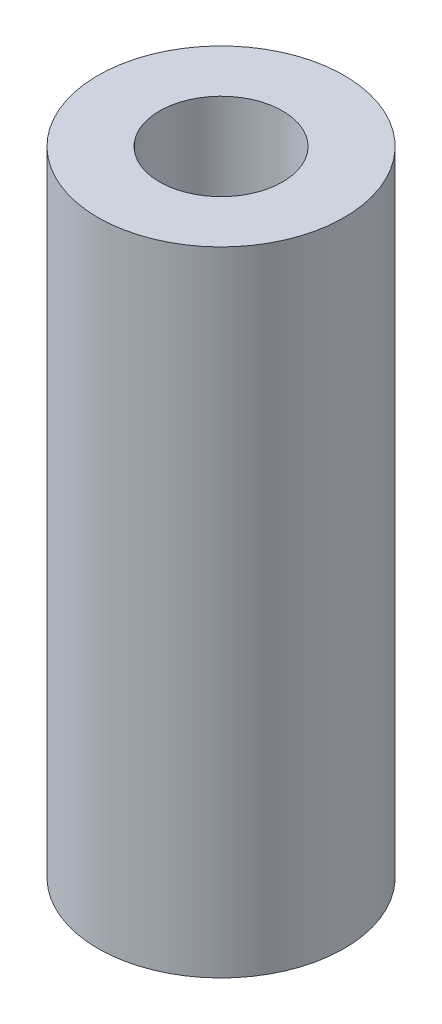
ISO-10303-21;
HEADER;
FILE_DESCRIPTION(('STEP AP214'),'2;1');
FILE_NAME('part.step','',(''),(''),'','','');
FILE_SCHEMA(('AUTOMOTIVE_DESIGN { 1 0 10303 214 1 1 1 1 }'));
ENDSEC;
DATA;
#1=APPLICATION_CONTEXT('core data for automotive mechanical design processes');
#2=APPLICATION_PROTOCOL_DEFINITION('international standard','automotive_design',2000,#1);
#3=PRODUCT_CONTEXT('',#1,'mechanical');
#4=PRODUCT('Part','Part','',(#3));
#5=PRODUCT_RELATED_PRODUCT_CATEGORY('part','',(#4));
#6=PRODUCT_DEFINITION_FORMATION('','',#4);
#7=PRODUCT_DEFINITION_CONTEXT('part definition',#1,'design');
#8=PRODUCT_DEFINITION('design','',#6,#7);
#9=PRODUCT_DEFINITION_SHAPE('','',#8);
#10=(LENGTH_UNIT() NAMED_UNIT(*) SI_UNIT(.MILLI.,.METRE.));
#11=(NAMED_UNIT(*) PLANE_ANGLE_UNIT() SI_UNIT($,.RADIAN.));
#12=(NAMED_UNIT(*) SI_UNIT($,.STERADIAN.) SOLID_ANGLE_UNIT());
#13=UNCERTAINTY_MEASURE_WITH_UNIT(LENGTH_MEASURE(1.E-05),#10,'distance_accuracy_value','');
#14=(GEOMETRIC_REPRESENTATION_CONTEXT(3) GLOBAL_UNCERTAINTY_ASSIGNED_CONTEXT((#13)) GLOBAL_UNIT_ASSIGNED_CONTEXT((#10,
#11,#12)) REPRESENTATION_CONTEXT('',''));
#15=CARTESIAN_POINT('',(0.,0.,0.));
#16=DIRECTION('',(0.,0.,1.));
#17=DIRECTION('',(1.,0.,0.));
#18=AXIS2_PLACEMENT_3D('',#15,#16,#17);
#19=CARTESIAN_POINT('',(0.,18.,0.));
#20=DIRECTION('',(0.,1.,0.));
#21=DIRECTION('',(0.,0.,1.));
#22=AXIS2_PLACEMENT_3D('',#19,#20,#21);
#23=PLANE('',#22);
#24=CARTESIAN_POINT('',(0.,18.,0.));
#25=DIRECTION('',(0.,1.,0.));
#26=DIRECTION('',(0.,0.,1.));
#27=AXIS2_PLACEMENT_3D('',#24,#25,#26);
#28=CIRCLE('',#27,3.5);
#29=CARTESIAN_POINT('',(0.,18.,3.5));
#30=VERTEX_POINT('',#29);
#31=EDGE_CURVE('E10',#30,#30,#28,.T.);
#32=ORIENTED_EDGE('',*,*,#31,.T.);
#33=EDGE_LOOP('',(#32));
#34=FACE_BOUND('',#33,.T.);
#35=CARTESIAN_POINT('',(0.,18.,0.));
#36=DIRECTION('',(0.,1.,0.));
#37=DIRECTION('',(0.,0.,1.));
#38=AXIS2_PLACEMENT_3D('',#35,#36,#37);
#39=CIRCLE('',#38,1.75);
#40=CARTESIAN_POINT('',(0.,18.,1.75));
#41=VERTEX_POINT('',#40);
#42=EDGE_CURVE('E42',#41,#41,#39,.T.);
#43=ORIENTED_EDGE('',*,*,#42,.F.);
#44=EDGE_LOOP('',(#43));
#45=FACE_BOUND('',#44,.T.);
#46=ADVANCED_FACE('F31',(#34,#45),#23,.T.);
#47=CARTESIAN_POINT('',(0.,0.,0.));
#48=DIRECTION('',(0.,1.,0.));
#49=DIRECTION('',(0.,0.,1.));
#50=AXIS2_PLACEMENT_3D('',#47,#48,#49);
#51=PLANE('',#50);
#52=CARTESIAN_POINT('',(0.,0.,0.));
#53=DIRECTION('',(0.,1.,0.));
#54=DIRECTION('',(0.,0.,1.));
#55=AXIS2_PLACEMENT_3D('',#52,#53,#54);
#56=CIRCLE('',#55,3.5);
#57=CARTESIAN_POINT('',(0.,0.,3.5));
#58=VERTEX_POINT('',#57);
#59=EDGE_CURVE('E35',#58,#58,#56,.T.);
#60=ORIENTED_EDGE('',*,*,#59,.F.);
#61=EDGE_LOOP('',(#60));
#62=FACE_BOUND('',#61,.T.);
#63=CARTESIAN_POINT('',(0.,0.,0.));
#64=DIRECTION('',(0.,1.,0.));
#65=DIRECTION('',(0.,0.,1.));
#66=AXIS2_PLACEMENT_3D('',#63,#64,#65);
#67=CIRCLE('',#66,1.75);
#68=CARTESIAN_POINT('',(0.,0.,1.75));
#69=VERTEX_POINT('',#68);
#70=EDGE_CURVE('E44',#69,#69,#67,.T.);
#71=ORIENTED_EDGE('',*,*,#70,.T.);
#72=EDGE_LOOP('',(#71));
#73=FACE_BOUND('',#72,.T.);
#74=ADVANCED_FACE('F54',(#62,#73),#51,.F.);
#75=CARTESIAN_POINT('',(0.,18.,0.));
#76=DIRECTION('',(0.,-1.,0.));
#77=DIRECTION('',(0.,0.,-1.));
#78=AXIS2_PLACEMENT_3D('',#75,#76,#77);
#79=CYLINDRICAL_SURFACE('',#78,3.5);
#80=ORIENTED_EDGE('',*,*,#31,.F.);
#81=EDGE_LOOP('',(#80));
#82=FACE_BOUND('',#81,.T.);
#83=ORIENTED_EDGE('',*,*,#59,.T.);
#84=EDGE_LOOP('',(#83));
#85=FACE_BOUND('',#84,.T.);
#86=ADVANCED_FACE('F33',(#82,#85),#79,.T.);
#87=CARTESIAN_POINT('',(0.,18.,0.));
#88=DIRECTION('',(0.,-1.,0.));
#89=DIRECTION('',(0.,0.,-1.));
#90=AXIS2_PLACEMENT_3D('',#87,#88,#89);
#91=CYLINDRICAL_SURFACE('',#90,1.75);
#92=ORIENTED_EDGE('',*,*,#42,.T.);
#93=EDGE_LOOP('',(#92));
#94=FACE_BOUND('',#93,.T.);
#95=ORIENTED_EDGE('',*,*,#70,.F.);
#96=EDGE_LOOP('',(#95));
#97=FACE_BOUND('',#96,.T.);
#98=ADVANCED_FACE('F50',(#94,#97),#91,.F.);
#99=CLOSED_SHELL('',(#46,#74,#86,#98));
#100=MANIFOLD_SOLID_BREP('B2',#99);
#101=ADVANCED_BREP_SHAPE_REPRESENTATION('',(#18,#100),#14);
#102=SHAPE_DEFINITION_REPRESENTATION(#9,#101);
ENDSEC;
END-ISO-10303-21;
